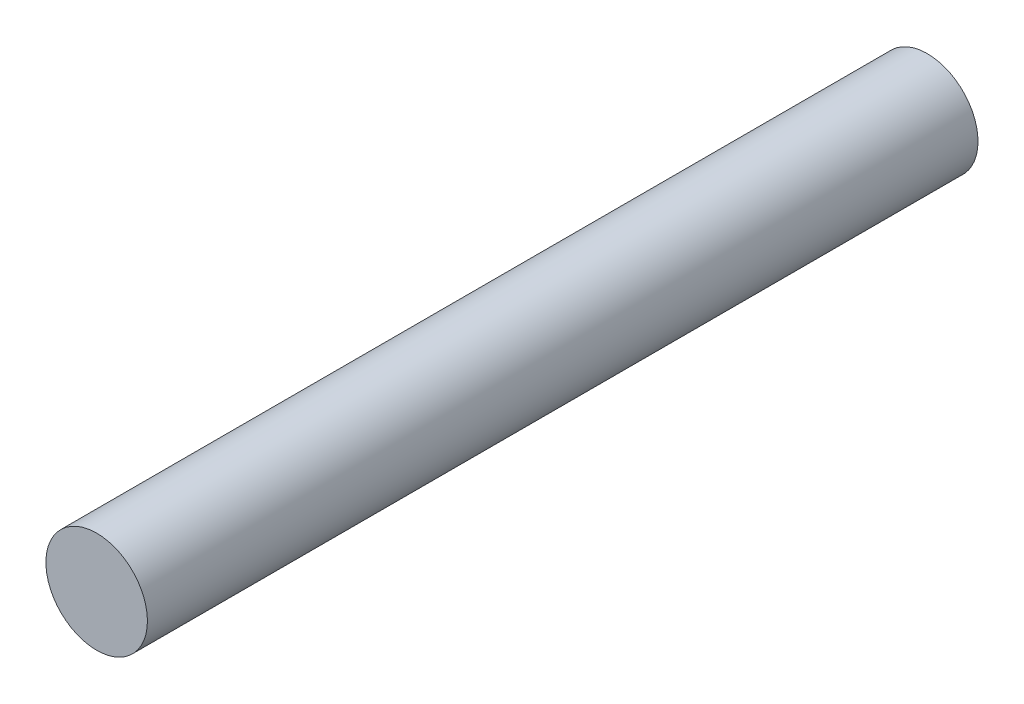
ISO-10303-21;
HEADER;
FILE_DESCRIPTION(('STEP AP214'),'2;1');
FILE_NAME('part.step','',(''),(''),'','','');
FILE_SCHEMA(('AUTOMOTIVE_DESIGN { 1 0 10303 214 1 1 1 1 }'));
ENDSEC;
DATA;
#1=APPLICATION_CONTEXT('core data for automotive mechanical design processes');
#2=APPLICATION_PROTOCOL_DEFINITION('international standard','automotive_design',2000,#1);
#3=PRODUCT_CONTEXT('',#1,'mechanical');
#4=PRODUCT('Part','Part','',(#3));
#5=PRODUCT_RELATED_PRODUCT_CATEGORY('part','',(#4));
#6=PRODUCT_DEFINITION_FORMATION('','',#4);
#7=PRODUCT_DEFINITION_CONTEXT('part definition',#1,'design');
#8=PRODUCT_DEFINITION('design','',#6,#7);
#9=PRODUCT_DEFINITION_SHAPE('','',#8);
#10=(LENGTH_UNIT() NAMED_UNIT(*) SI_UNIT(.MILLI.,.METRE.));
#11=(NAMED_UNIT(*) PLANE_ANGLE_UNIT() SI_UNIT($,.RADIAN.));
#12=(NAMED_UNIT(*) SI_UNIT($,.STERADIAN.) SOLID_ANGLE_UNIT());
#13=UNCERTAINTY_MEASURE_WITH_UNIT(LENGTH_MEASURE(1.E-05),#10,'distance_accuracy_value','');
#14=(GEOMETRIC_REPRESENTATION_CONTEXT(3) GLOBAL_UNCERTAINTY_ASSIGNED_CONTEXT((#13)) GLOBAL_UNIT_ASSIGNED_CONTEXT((#10,
#11,#12)) REPRESENTATION_CONTEXT('',''));
#15=CARTESIAN_POINT('',(0.,0.,0.));
#16=DIRECTION('',(0.,0.,1.));
#17=DIRECTION('',(1.,0.,0.));
#18=AXIS2_PLACEMENT_3D('',#15,#16,#17);
#19=CARTESIAN_POINT('',(0.,0.,90.));
#20=DIRECTION('',(0.,0.,-1.));
#21=DIRECTION('',(-1.,0.,0.));
#22=AXIS2_PLACEMENT_3D('',#19,#20,#21);
#23=CYLINDRICAL_SURFACE('',#22,5.5);
#24=CARTESIAN_POINT('',(0.,0.,90.));
#25=DIRECTION('',(0.,0.,1.));
#26=DIRECTION('',(1.,0.,0.));
#27=AXIS2_PLACEMENT_3D('',#24,#25,#26);
#28=CIRCLE('',#27,5.5);
#29=CARTESIAN_POINT('',(5.5,0.,90.));
#30=VERTEX_POINT('',#29);
#31=EDGE_CURVE('E10',#30,#30,#28,.T.);
#32=ORIENTED_EDGE('',*,*,#31,.F.);
#33=EDGE_LOOP('',(#32));
#34=FACE_BOUND('',#33,.T.);
#35=CARTESIAN_POINT('',(0.,0.,0.));
#36=DIRECTION('',(0.,0.,1.));
#37=DIRECTION('',(1.,0.,0.));
#38=AXIS2_PLACEMENT_3D('',#35,#36,#37);
#39=CIRCLE('',#38,5.5);
#40=CARTESIAN_POINT('',(5.5,0.,0.));
#41=VERTEX_POINT('',#40);
#42=EDGE_CURVE('E44',#41,#41,#39,.T.);
#43=ORIENTED_EDGE('',*,*,#42,.T.);
#44=EDGE_LOOP('',(#43));
#45=FACE_BOUND('',#44,.T.);
#46=ADVANCED_FACE('F41',(#34,#45),#23,.T.);
#47=CARTESIAN_POINT('',(0.,0.,90.));
#48=DIRECTION('',(0.,0.,1.));
#49=DIRECTION('',(1.,0.,0.));
#50=AXIS2_PLACEMENT_3D('',#47,#48,#49);
#51=PLANE('',#50);
#52=ORIENTED_EDGE('',*,*,#31,.T.);
#53=EDGE_LOOP('',(#52));
#54=FACE_BOUND('',#53,.T.);
#55=ADVANCED_FACE('F56',(#54),#51,.T.);
#56=CARTESIAN_POINT('',(0.,0.,0.));
#57=DIRECTION('',(0.,0.,1.));
#58=DIRECTION('',(1.,0.,0.));
#59=AXIS2_PLACEMENT_3D('',#56,#57,#58);
#60=PLANE('',#59);
#61=ORIENTED_EDGE('',*,*,#42,.F.);
#62=EDGE_LOOP('',(#61));
#63=FACE_BOUND('',#62,.T.);
#64=ADVANCED_FACE('F54',(#63),#60,.F.);
#65=CLOSED_SHELL('',(#46,#55,#64));
#66=MANIFOLD_SOLID_BREP('B2',#65);
#67=ADVANCED_BREP_SHAPE_REPRESENTATION('',(#18,#66),#14);
#68=SHAPE_DEFINITION_REPRESENTATION(#9,#67);
ENDSEC;
END-ISO-10303-21;
